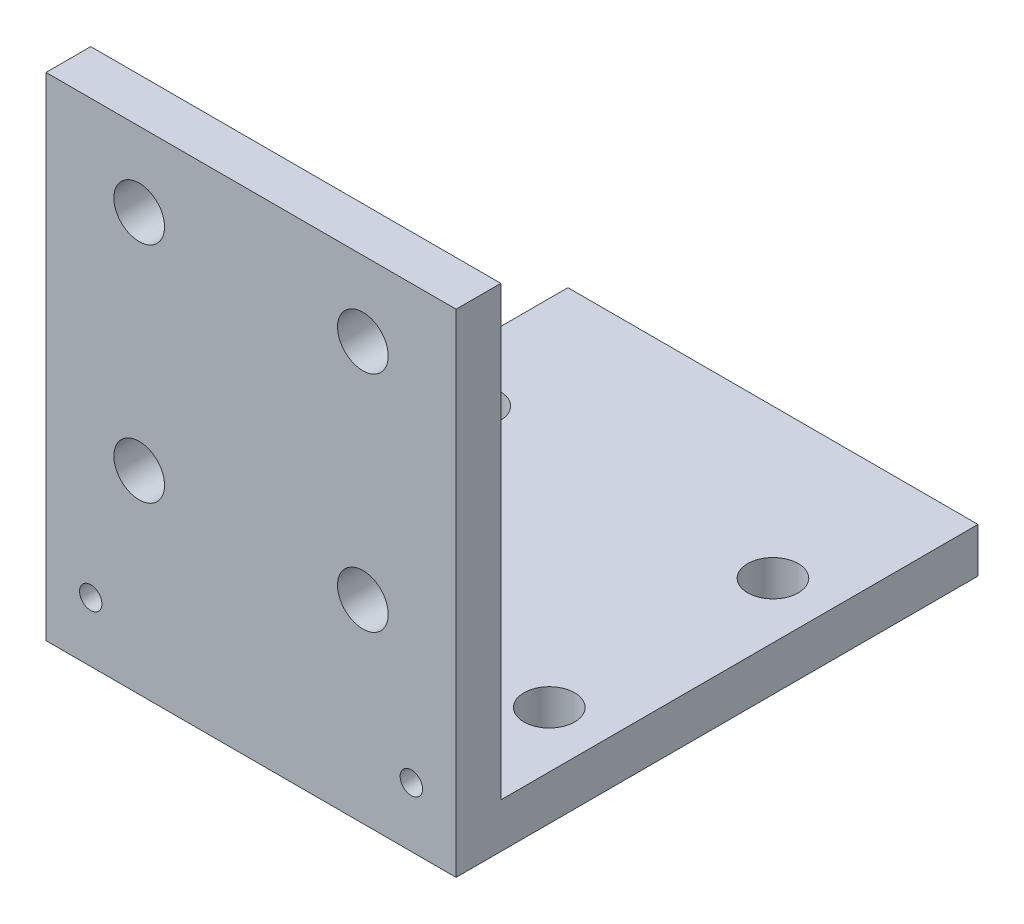
ISO-10303-21;
HEADER;
FILE_DESCRIPTION(('STEP AP214'),'2;1');
FILE_NAME('part.step','',(''),(''),'','','');
FILE_SCHEMA(('AUTOMOTIVE_DESIGN { 1 0 10303 214 1 1 1 1 }'));
ENDSEC;
DATA;
#1=APPLICATION_CONTEXT('core data for automotive mechanical design processes');
#2=APPLICATION_PROTOCOL_DEFINITION('international standard','automotive_design',2000,#1);
#3=PRODUCT_CONTEXT('',#1,'mechanical');
#4=PRODUCT('Part','Part','',(#3));
#5=PRODUCT_RELATED_PRODUCT_CATEGORY('part','',(#4));
#6=PRODUCT_DEFINITION_FORMATION('','',#4);
#7=PRODUCT_DEFINITION_CONTEXT('part definition',#1,'design');
#8=PRODUCT_DEFINITION('design','',#6,#7);
#9=PRODUCT_DEFINITION_SHAPE('','',#8);
#10=(LENGTH_UNIT() NAMED_UNIT(*) SI_UNIT(.MILLI.,.METRE.));
#11=(NAMED_UNIT(*) PLANE_ANGLE_UNIT() SI_UNIT($,.RADIAN.));
#12=(NAMED_UNIT(*) SI_UNIT($,.STERADIAN.) SOLID_ANGLE_UNIT());
#13=UNCERTAINTY_MEASURE_WITH_UNIT(LENGTH_MEASURE(1.E-05),#10,'distance_accuracy_value','');
#14=(GEOMETRIC_REPRESENTATION_CONTEXT(3) GLOBAL_UNCERTAINTY_ASSIGNED_CONTEXT((#13)) GLOBAL_UNIT_ASSIGNED_CONTEXT((#10,
#11,#12)) REPRESENTATION_CONTEXT('',''));
#15=CARTESIAN_POINT('',(0.,0.,0.));
#16=DIRECTION('',(0.,0.,1.));
#17=DIRECTION('',(1.,0.,0.));
#18=AXIS2_PLACEMENT_3D('',#15,#16,#17);
#19=CARTESIAN_POINT('',(13.75,1.5,35.));
#20=DIRECTION('',(-1.,0.,0.));
#21=DIRECTION('',(0.,0.,1.));
#22=AXIS2_PLACEMENT_3D('',#19,#20,#21);
#23=PLANE('',#22);
#24=DIRECTION('',(0.,-1.,0.));
#25=VECTOR('',#24,1.);
#26=CARTESIAN_POINT('',(13.75,41.5,32.));
#27=LINE('',#26,#25);
#28=CARTESIAN_POINT('',(13.75,31.5,32.));
#29=VERTEX_POINT('',#28);
#30=CARTESIAN_POINT('',(13.75,1.5,32.));
#31=VERTEX_POINT('',#30);
#32=EDGE_CURVE('E57',#29,#31,#27,.T.);
#33=ORIENTED_EDGE('',*,*,#32,.F.);
#34=DIRECTION('',(0.,0.,-1.));
#35=VECTOR('',#34,1.);
#36=CARTESIAN_POINT('',(13.75,31.5,35.));
#37=LINE('',#36,#35);
#38=CARTESIAN_POINT('',(13.75,31.5,35.));
#39=VERTEX_POINT('',#38);
#40=EDGE_CURVE('E50',#39,#29,#37,.T.);
#41=ORIENTED_EDGE('',*,*,#40,.F.);
#42=DIRECTION('',(0.,1.,0.));
#43=VECTOR('',#42,1.);
#44=CARTESIAN_POINT('',(13.75,1.5,35.));
#45=LINE('',#44,#43);
#46=CARTESIAN_POINT('',(13.75,-1.5,35.));
#47=VERTEX_POINT('',#46);
#48=EDGE_CURVE('E98',#47,#39,#45,.T.);
#49=ORIENTED_EDGE('',*,*,#48,.F.);
#50=DIRECTION('',(0.,0.,-1.));
#51=VECTOR('',#50,1.);
#52=CARTESIAN_POINT('',(13.75,-1.5,35.));
#53=LINE('',#52,#51);
#54=CARTESIAN_POINT('',(13.75,-1.5,0.));
#55=VERTEX_POINT('',#54);
#56=EDGE_CURVE('E117',#47,#55,#53,.T.);
#57=ORIENTED_EDGE('',*,*,#56,.T.);
#58=DIRECTION('',(0.,1.,0.));
#59=VECTOR('',#58,1.);
#60=CARTESIAN_POINT('',(13.75,1.5,0.));
#61=LINE('',#60,#59);
#62=CARTESIAN_POINT('',(13.75,1.5,0.));
#63=VERTEX_POINT('',#62);
#64=EDGE_CURVE('E118',#55,#63,#61,.T.);
#65=ORIENTED_EDGE('',*,*,#64,.T.);
#66=DIRECTION('',(0.,0.,-1.));
#67=VECTOR('',#66,1.);
#68=CARTESIAN_POINT('',(13.75,1.5,35.));
#69=LINE('',#68,#67);
#70=EDGE_CURVE('E11',#31,#63,#69,.T.);
#71=ORIENTED_EDGE('',*,*,#70,.F.);
#72=EDGE_LOOP('',(#33,#41,#49,#57,#65,#71));
#73=FACE_BOUND('',#72,.T.);
#74=ADVANCED_FACE('F34',(#73),#23,.F.);
#75=CARTESIAN_POINT('',(-13.75,1.5,35.));
#76=DIRECTION('',(0.,-1.,0.));
#77=DIRECTION('',(0.,0.,-1.));
#78=AXIS2_PLACEMENT_3D('',#75,#76,#77);
#79=PLANE('',#78);
#80=CARTESIAN_POINT('',(-10.,1.5,10.));
#81=DIRECTION('',(0.,1.,0.));
#82=DIRECTION('',(0.,0.,1.));
#83=AXIS2_PLACEMENT_3D('',#80,#81,#82);
#84=CIRCLE('',#83,1.69999999999999);
#85=CARTESIAN_POINT('',(-10.,1.5,11.7));
#86=VERTEX_POINT('',#85);
#87=EDGE_CURVE('E131',#86,#86,#84,.T.);
#88=ORIENTED_EDGE('',*,*,#87,.F.);
#89=EDGE_LOOP('',(#88));
#90=FACE_BOUND('',#89,.T.);
#91=CARTESIAN_POINT('',(-9.99999999999999,1.5,25.));
#92=DIRECTION('',(0.,1.,0.));
#93=DIRECTION('',(0.,0.,1.));
#94=AXIS2_PLACEMENT_3D('',#91,#92,#93);
#95=CIRCLE('',#94,1.69999999999999);
#96=CARTESIAN_POINT('',(-9.99999999999999,1.5,26.7));
#97=VERTEX_POINT('',#96);
#98=EDGE_CURVE('E150',#97,#97,#95,.T.);
#99=ORIENTED_EDGE('',*,*,#98,.F.);
#100=EDGE_LOOP('',(#99));
#101=FACE_BOUND('',#100,.T.);
#102=CARTESIAN_POINT('',(10.,1.5,25.));
#103=DIRECTION('',(0.,1.,0.));
#104=DIRECTION('',(0.,0.,1.));
#105=AXIS2_PLACEMENT_3D('',#102,#103,#104);
#106=CIRCLE('',#105,1.69999999999999);
#107=CARTESIAN_POINT('',(10.,1.5,26.7));
#108=VERTEX_POINT('',#107);
#109=EDGE_CURVE('E156',#108,#108,#106,.T.);
#110=ORIENTED_EDGE('',*,*,#109,.F.);
#111=EDGE_LOOP('',(#110));
#112=FACE_BOUND('',#111,.T.);
#113=CARTESIAN_POINT('',(9.99999999999999,1.5,10.));
#114=DIRECTION('',(0.,1.,0.));
#115=DIRECTION('',(0.,0.,1.));
#116=AXIS2_PLACEMENT_3D('',#113,#114,#115);
#117=CIRCLE('',#116,1.69999999999999);
#118=CARTESIAN_POINT('',(9.99999999999999,1.5,11.7));
#119=VERTEX_POINT('',#118);
#120=EDGE_CURVE('E162',#119,#119,#117,.T.);
#121=ORIENTED_EDGE('',*,*,#120,.F.);
#122=EDGE_LOOP('',(#121));
#123=FACE_BOUND('',#122,.T.);
#124=DIRECTION('',(0.,0.,-1.));
#125=VECTOR('',#124,1.);
#126=CARTESIAN_POINT('',(-13.75,1.5,35.));
#127=LINE('',#126,#125);
#128=CARTESIAN_POINT('',(-13.75,1.5,32.));
#129=VERTEX_POINT('',#128);
#130=CARTESIAN_POINT('',(-13.75,1.5,0.));
#131=VERTEX_POINT('',#130);
#132=EDGE_CURVE('E42',#129,#131,#127,.T.);
#133=ORIENTED_EDGE('',*,*,#132,.F.);
#134=DIRECTION('',(1.,0.,0.));
#135=VECTOR('',#134,1.);
#136=CARTESIAN_POINT('',(0.,1.5,32.));
#137=LINE('',#136,#135);
#138=EDGE_CURVE('E168',#129,#31,#137,.T.);
#139=ORIENTED_EDGE('',*,*,#138,.T.);
#140=ORIENTED_EDGE('',*,*,#70,.T.);
#141=DIRECTION('',(-1.,0.,0.));
#142=VECTOR('',#141,1.);
#143=CARTESIAN_POINT('',(-13.75,1.5,0.));
#144=LINE('',#143,#142);
#145=EDGE_CURVE('E121',#63,#131,#144,.T.);
#146=ORIENTED_EDGE('',*,*,#145,.T.);
#147=EDGE_LOOP('',(#133,#139,#140,#146));
#148=FACE_BOUND('',#147,.T.);
#149=ADVANCED_FACE('F176',(#90,#101,#112,#123,#148),#79,.F.);
#150=CARTESIAN_POINT('',(-13.75,1.5,35.));
#151=DIRECTION('',(1.,0.,0.));
#152=DIRECTION('',(0.,0.,-1.));
#153=AXIS2_PLACEMENT_3D('',#150,#151,#152);
#154=PLANE('',#153);
#155=DIRECTION('',(0.,-1.,0.));
#156=VECTOR('',#155,1.);
#157=CARTESIAN_POINT('',(-13.75,1.5,35.));
#158=LINE('',#157,#156);
#159=CARTESIAN_POINT('',(-13.75,31.5,35.));
#160=VERTEX_POINT('',#159);
#161=CARTESIAN_POINT('',(-13.75,-1.5,35.));
#162=VERTEX_POINT('',#161);
#163=EDGE_CURVE('E106',#160,#162,#158,.T.);
#164=ORIENTED_EDGE('',*,*,#163,.F.);
#165=DIRECTION('',(0.,0.,-1.));
#166=VECTOR('',#165,1.);
#167=CARTESIAN_POINT('',(-13.75,31.5,35.));
#168=LINE('',#167,#166);
#169=CARTESIAN_POINT('',(-13.75,31.5,32.));
#170=VERTEX_POINT('',#169);
#171=EDGE_CURVE('E89',#160,#170,#168,.T.);
#172=ORIENTED_EDGE('',*,*,#171,.T.);
#173=DIRECTION('',(0.,-1.,0.));
#174=VECTOR('',#173,1.);
#175=CARTESIAN_POINT('',(-13.75,41.5,32.));
#176=LINE('',#175,#174);
#177=EDGE_CURVE('E113',#170,#129,#176,.T.);
#178=ORIENTED_EDGE('',*,*,#177,.T.);
#179=ORIENTED_EDGE('',*,*,#132,.T.);
#180=DIRECTION('',(0.,-1.,0.));
#181=VECTOR('',#180,1.);
#182=CARTESIAN_POINT('',(-13.75,1.5,0.));
#183=LINE('',#182,#181);
#184=CARTESIAN_POINT('',(-13.75,-1.5,0.));
#185=VERTEX_POINT('',#184);
#186=EDGE_CURVE('E110',#131,#185,#183,.T.);
#187=ORIENTED_EDGE('',*,*,#186,.T.);
#188=DIRECTION('',(0.,0.,-1.));
#189=VECTOR('',#188,1.);
#190=CARTESIAN_POINT('',(-13.75,-1.5,35.));
#191=LINE('',#190,#189);
#192=EDGE_CURVE('E126',#162,#185,#191,.T.);
#193=ORIENTED_EDGE('',*,*,#192,.F.);
#194=EDGE_LOOP('',(#164,#172,#178,#179,#187,#193));
#195=FACE_BOUND('',#194,.T.);
#196=ADVANCED_FACE('F171',(#195),#154,.F.);
#197=CARTESIAN_POINT('',(-13.75,-1.5,35.));
#198=DIRECTION('',(0.,1.,0.));
#199=DIRECTION('',(0.,0.,1.));
#200=AXIS2_PLACEMENT_3D('',#197,#198,#199);
#201=PLANE('',#200);
#202=CARTESIAN_POINT('',(-10.,-1.5,10.));
#203=DIRECTION('',(0.,1.,0.));
#204=DIRECTION('',(0.,0.,1.));
#205=AXIS2_PLACEMENT_3D('',#202,#203,#204);
#206=CIRCLE('',#205,1.69999999999999);
#207=CARTESIAN_POINT('',(-10.,-1.5,11.7));
#208=VERTEX_POINT('',#207);
#209=EDGE_CURVE('E136',#208,#208,#206,.T.);
#210=ORIENTED_EDGE('',*,*,#209,.T.);
#211=EDGE_LOOP('',(#210));
#212=FACE_BOUND('',#211,.T.);
#213=CARTESIAN_POINT('',(-9.99999999999999,-1.5,25.));
#214=DIRECTION('',(0.,1.,0.));
#215=DIRECTION('',(0.,0.,1.));
#216=AXIS2_PLACEMENT_3D('',#213,#214,#215);
#217=CIRCLE('',#216,1.69999999999999);
#218=CARTESIAN_POINT('',(-9.99999999999999,-1.5,26.7));
#219=VERTEX_POINT('',#218);
#220=EDGE_CURVE('E153',#219,#219,#217,.T.);
#221=ORIENTED_EDGE('',*,*,#220,.T.);
#222=EDGE_LOOP('',(#221));
#223=FACE_BOUND('',#222,.T.);
#224=CARTESIAN_POINT('',(10.,-1.5,25.));
#225=DIRECTION('',(0.,1.,0.));
#226=DIRECTION('',(0.,0.,1.));
#227=AXIS2_PLACEMENT_3D('',#224,#225,#226);
#228=CIRCLE('',#227,1.69999999999999);
#229=CARTESIAN_POINT('',(10.,-1.5,26.7));
#230=VERTEX_POINT('',#229);
#231=EDGE_CURVE('E159',#230,#230,#228,.T.);
#232=ORIENTED_EDGE('',*,*,#231,.T.);
#233=EDGE_LOOP('',(#232));
#234=FACE_BOUND('',#233,.T.);
#235=CARTESIAN_POINT('',(9.99999999999999,-1.5,10.));
#236=DIRECTION('',(0.,1.,0.));
#237=DIRECTION('',(0.,0.,1.));
#238=AXIS2_PLACEMENT_3D('',#235,#236,#237);
#239=CIRCLE('',#238,1.69999999999999);
#240=CARTESIAN_POINT('',(9.99999999999999,-1.5,11.7));
#241=VERTEX_POINT('',#240);
#242=EDGE_CURVE('E165',#241,#241,#239,.T.);
#243=ORIENTED_EDGE('',*,*,#242,.T.);
#244=EDGE_LOOP('',(#243));
#245=FACE_BOUND('',#244,.T.);
#246=DIRECTION('',(1.,0.,0.));
#247=VECTOR('',#246,1.);
#248=CARTESIAN_POINT('',(-13.75,-1.5,0.));
#249=LINE('',#248,#247);
#250=EDGE_CURVE('E107',#185,#55,#249,.T.);
#251=ORIENTED_EDGE('',*,*,#250,.T.);
#252=ORIENTED_EDGE('',*,*,#56,.F.);
#253=DIRECTION('',(1.,0.,0.));
#254=VECTOR('',#253,1.);
#255=CARTESIAN_POINT('',(-13.75,-1.5,35.));
#256=LINE('',#255,#254);
#257=EDGE_CURVE('E104',#162,#47,#256,.T.);
#258=ORIENTED_EDGE('',*,*,#257,.F.);
#259=ORIENTED_EDGE('',*,*,#192,.T.);
#260=EDGE_LOOP('',(#251,#252,#258,#259));
#261=FACE_BOUND('',#260,.T.);
#262=ADVANCED_FACE('F185',(#212,#223,#234,#245,#261),#201,.F.);
#263=CARTESIAN_POINT('',(0.,0.,35.));
#264=DIRECTION('',(0.,0.,1.));
#265=DIRECTION('',(1.,0.,0.));
#266=AXIS2_PLACEMENT_3D('',#263,#264,#265);
#267=PLANE('',#266);
#268=DIRECTION('',(-1.,0.,0.));
#269=VECTOR('',#268,1.);
#270=CARTESIAN_POINT('',(0.,31.5,35.));
#271=LINE('',#270,#269);
#272=EDGE_CURVE('E86',#39,#160,#271,.T.);
#273=ORIENTED_EDGE('',*,*,#272,.T.);
#274=ORIENTED_EDGE('',*,*,#163,.T.);
#275=ORIENTED_EDGE('',*,*,#257,.T.);
#276=ORIENTED_EDGE('',*,*,#48,.T.);
#277=EDGE_LOOP('',(#273,#274,#275,#276));
#278=FACE_BOUND('',#277,.T.);
#279=CARTESIAN_POINT('',(10.75,2.5,35.));
#280=DIRECTION('',(0.,0.,-1.));
#281=DIRECTION('',(-1.,0.,0.));
#282=AXIS2_PLACEMENT_3D('',#279,#280,#281);
#283=CIRCLE('',#282,0.75);
#284=CARTESIAN_POINT('',(10.,2.5,35.));
#285=VERTEX_POINT('',#284);
#286=EDGE_CURVE('E409',#285,#285,#283,.T.);
#287=ORIENTED_EDGE('',*,*,#286,.T.);
#288=EDGE_LOOP('',(#287));
#289=FACE_BOUND('',#288,.T.);
#290=CARTESIAN_POINT('',(7.5,11.5,35.));
#291=DIRECTION('',(0.,0.,1.));
#292=DIRECTION('',(1.,0.,0.));
#293=AXIS2_PLACEMENT_3D('',#290,#291,#292);
#294=CIRCLE('',#293,1.69999999999999);
#295=CARTESIAN_POINT('',(9.19999999999999,11.5,35.));
#296=VERTEX_POINT('',#295);
#297=EDGE_CURVE('E403',#296,#296,#294,.T.);
#298=ORIENTED_EDGE('',*,*,#297,.F.);
#299=EDGE_LOOP('',(#298));
#300=FACE_BOUND('',#299,.T.);
#301=CARTESIAN_POINT('',(-7.5,11.5,35.));
#302=DIRECTION('',(0.,0.,1.));
#303=DIRECTION('',(1.,0.,0.));
#304=AXIS2_PLACEMENT_3D('',#301,#302,#303);
#305=CIRCLE('',#304,1.69999999999999);
#306=CARTESIAN_POINT('',(-5.80000000000001,11.5,35.));
#307=VERTEX_POINT('',#306);
#308=EDGE_CURVE('E397',#307,#307,#305,.T.);
#309=ORIENTED_EDGE('',*,*,#308,.F.);
#310=EDGE_LOOP('',(#309));
#311=FACE_BOUND('',#310,.T.);
#312=CARTESIAN_POINT('',(-7.5,26.5,35.));
#313=DIRECTION('',(0.,0.,1.));
#314=DIRECTION('',(1.,0.,0.));
#315=AXIS2_PLACEMENT_3D('',#312,#313,#314);
#316=CIRCLE('',#315,1.69999999999999);
#317=CARTESIAN_POINT('',(-5.80000000000001,26.5,35.));
#318=VERTEX_POINT('',#317);
#319=EDGE_CURVE('E390',#318,#318,#316,.T.);
#320=ORIENTED_EDGE('',*,*,#319,.F.);
#321=EDGE_LOOP('',(#320));
#322=FACE_BOUND('',#321,.T.);
#323=CARTESIAN_POINT('',(7.5,26.5,35.));
#324=DIRECTION('',(0.,0.,1.));
#325=DIRECTION('',(1.,0.,0.));
#326=AXIS2_PLACEMENT_3D('',#323,#324,#325);
#327=CIRCLE('',#326,1.69999999999999);
#328=CARTESIAN_POINT('',(9.19999999999999,26.5,35.));
#329=VERTEX_POINT('',#328);
#330=EDGE_CURVE('E139',#329,#329,#327,.T.);
#331=ORIENTED_EDGE('',*,*,#330,.F.);
#332=EDGE_LOOP('',(#331));
#333=FACE_BOUND('',#332,.T.);
#334=CARTESIAN_POINT('',(-10.75,2.5,35.));
#335=DIRECTION('',(0.,0.,1.));
#336=DIRECTION('',(1.,0.,0.));
#337=AXIS2_PLACEMENT_3D('',#334,#335,#336);
#338=CIRCLE('',#337,0.75);
#339=CARTESIAN_POINT('',(-10.,2.5,35.));
#340=VERTEX_POINT('',#339);
#341=EDGE_CURVE('E132',#340,#340,#338,.T.);
#342=ORIENTED_EDGE('',*,*,#341,.F.);
#343=EDGE_LOOP('',(#342));
#344=FACE_BOUND('',#343,.T.);
#345=ADVANCED_FACE('F101',(#278,#289,#300,#311,#322,#333,#344),#267,.T.);
#346=CARTESIAN_POINT('',(0.,0.,0.));
#347=DIRECTION('',(0.,0.,1.));
#348=DIRECTION('',(1.,0.,0.));
#349=AXIS2_PLACEMENT_3D('',#346,#347,#348);
#350=PLANE('',#349);
#351=ORIENTED_EDGE('',*,*,#64,.F.);
#352=ORIENTED_EDGE('',*,*,#250,.F.);
#353=ORIENTED_EDGE('',*,*,#186,.F.);
#354=ORIENTED_EDGE('',*,*,#145,.F.);
#355=EDGE_LOOP('',(#351,#352,#353,#354));
#356=FACE_BOUND('',#355,.T.);
#357=ADVANCED_FACE('F182',(#356),#350,.F.);
#358=CARTESIAN_POINT('',(0.,41.5,32.));
#359=DIRECTION('',(0.,0.,-1.));
#360=DIRECTION('',(-1.,0.,0.));
#361=AXIS2_PLACEMENT_3D('',#358,#359,#360);
#362=PLANE('',#361);
#363=DIRECTION('',(-1.,0.,0.));
#364=VECTOR('',#363,1.);
#365=CARTESIAN_POINT('',(0.,31.5,32.));
#366=LINE('',#365,#364);
#367=EDGE_CURVE('E93',#29,#170,#366,.T.);
#368=ORIENTED_EDGE('',*,*,#367,.F.);
#369=ORIENTED_EDGE('',*,*,#32,.T.);
#370=ORIENTED_EDGE('',*,*,#138,.F.);
#371=ORIENTED_EDGE('',*,*,#177,.F.);
#372=EDGE_LOOP('',(#368,#369,#370,#371));
#373=FACE_BOUND('',#372,.T.);
#374=CARTESIAN_POINT('',(10.75,2.5,32.));
#375=DIRECTION('',(0.,0.,-1.));
#376=DIRECTION('',(-1.,0.,0.));
#377=AXIS2_PLACEMENT_3D('',#374,#375,#376);
#378=CIRCLE('',#377,0.75);
#379=CARTESIAN_POINT('',(10.,2.5,32.));
#380=VERTEX_POINT('',#379);
#381=EDGE_CURVE('E37',#380,#380,#378,.F.);
#382=ORIENTED_EDGE('',*,*,#381,.T.);
#383=EDGE_LOOP('',(#382));
#384=FACE_BOUND('',#383,.T.);
#385=CARTESIAN_POINT('',(7.5,11.5,32.));
#386=DIRECTION('',(0.,0.,-1.));
#387=DIRECTION('',(-1.,0.,0.));
#388=AXIS2_PLACEMENT_3D('',#385,#386,#387);
#389=CIRCLE('',#388,1.69999999999999);
#390=CARTESIAN_POINT('',(5.80000000000001,11.5,32.));
#391=VERTEX_POINT('',#390);
#392=EDGE_CURVE('E406',#391,#391,#389,.T.);
#393=ORIENTED_EDGE('',*,*,#392,.F.);
#394=EDGE_LOOP('',(#393));
#395=FACE_BOUND('',#394,.T.);
#396=CARTESIAN_POINT('',(-7.5,11.5,32.));
#397=DIRECTION('',(0.,0.,-1.));
#398=DIRECTION('',(-1.,0.,0.));
#399=AXIS2_PLACEMENT_3D('',#396,#397,#398);
#400=CIRCLE('',#399,1.69999999999999);
#401=CARTESIAN_POINT('',(-9.19999999999999,11.5,32.));
#402=VERTEX_POINT('',#401);
#403=EDGE_CURVE('E400',#402,#402,#400,.T.);
#404=ORIENTED_EDGE('',*,*,#403,.F.);
#405=EDGE_LOOP('',(#404));
#406=FACE_BOUND('',#405,.T.);
#407=CARTESIAN_POINT('',(-7.5,26.5,32.));
#408=DIRECTION('',(0.,0.,-1.));
#409=DIRECTION('',(-1.,0.,0.));
#410=AXIS2_PLACEMENT_3D('',#407,#408,#409);
#411=CIRCLE('',#410,1.69999999999999);
#412=CARTESIAN_POINT('',(-9.19999999999999,26.5,32.));
#413=VERTEX_POINT('',#412);
#414=EDGE_CURVE('E392',#413,#413,#411,.T.);
#415=ORIENTED_EDGE('',*,*,#414,.F.);
#416=EDGE_LOOP('',(#415));
#417=FACE_BOUND('',#416,.T.);
#418=CARTESIAN_POINT('',(7.5,26.5,32.));
#419=DIRECTION('',(0.,0.,-1.));
#420=DIRECTION('',(-1.,0.,0.));
#421=AXIS2_PLACEMENT_3D('',#418,#419,#420);
#422=CIRCLE('',#421,1.69999999999999);
#423=CARTESIAN_POINT('',(5.80000000000001,26.5,32.));
#424=VERTEX_POINT('',#423);
#425=EDGE_CURVE('E144',#424,#424,#422,.T.);
#426=ORIENTED_EDGE('',*,*,#425,.F.);
#427=EDGE_LOOP('',(#426));
#428=FACE_BOUND('',#427,.T.);
#429=CARTESIAN_POINT('',(-10.75,2.5,32.));
#430=DIRECTION('',(0.,0.,-1.));
#431=DIRECTION('',(-1.,0.,0.));
#432=AXIS2_PLACEMENT_3D('',#429,#430,#431);
#433=CIRCLE('',#432,0.75);
#434=CARTESIAN_POINT('',(-11.5,2.5,32.));
#435=VERTEX_POINT('',#434);
#436=EDGE_CURVE('E129',#435,#435,#433,.T.);
#437=ORIENTED_EDGE('',*,*,#436,.F.);
#438=EDGE_LOOP('',(#437));
#439=FACE_BOUND('',#438,.T.);
#440=ADVANCED_FACE('F173',(#373,#384,#395,#406,#417,#428,#439),#362,.T.);
#441=CARTESIAN_POINT('',(9.99999999999999,1.5,10.));
#442=DIRECTION('',(0.,1.,0.));
#443=DIRECTION('',(0.,0.,1.));
#444=AXIS2_PLACEMENT_3D('',#441,#442,#443);
#445=CYLINDRICAL_SURFACE('',#444,1.69999999999999);
#446=ORIENTED_EDGE('',*,*,#120,.T.);
#447=EDGE_LOOP('',(#446));
#448=FACE_BOUND('',#447,.T.);
#449=ORIENTED_EDGE('',*,*,#242,.F.);
#450=EDGE_LOOP('',(#449));
#451=FACE_BOUND('',#450,.T.);
#452=ADVANCED_FACE('F212',(#448,#451),#445,.F.);
#453=CARTESIAN_POINT('',(10.,1.5,25.));
#454=DIRECTION('',(0.,1.,0.));
#455=DIRECTION('',(0.,0.,1.));
#456=AXIS2_PLACEMENT_3D('',#453,#454,#455);
#457=CYLINDRICAL_SURFACE('',#456,1.69999999999999);
#458=ORIENTED_EDGE('',*,*,#109,.T.);
#459=EDGE_LOOP('',(#458));
#460=FACE_BOUND('',#459,.T.);
#461=ORIENTED_EDGE('',*,*,#231,.F.);
#462=EDGE_LOOP('',(#461));
#463=FACE_BOUND('',#462,.T.);
#464=ADVANCED_FACE('F215',(#460,#463),#457,.F.);
#465=CARTESIAN_POINT('',(-9.99999999999999,1.5,25.));
#466=DIRECTION('',(0.,1.,0.));
#467=DIRECTION('',(0.,0.,1.));
#468=AXIS2_PLACEMENT_3D('',#465,#466,#467);
#469=CYLINDRICAL_SURFACE('',#468,1.69999999999999);
#470=ORIENTED_EDGE('',*,*,#98,.T.);
#471=EDGE_LOOP('',(#470));
#472=FACE_BOUND('',#471,.T.);
#473=ORIENTED_EDGE('',*,*,#220,.F.);
#474=EDGE_LOOP('',(#473));
#475=FACE_BOUND('',#474,.T.);
#476=ADVANCED_FACE('F223',(#472,#475),#469,.F.);
#477=CARTESIAN_POINT('',(-10.,1.5,10.));
#478=DIRECTION('',(0.,1.,0.));
#479=DIRECTION('',(0.,0.,1.));
#480=AXIS2_PLACEMENT_3D('',#477,#478,#479);
#481=CYLINDRICAL_SURFACE('',#480,1.69999999999999);
#482=ORIENTED_EDGE('',*,*,#87,.T.);
#483=EDGE_LOOP('',(#482));
#484=FACE_BOUND('',#483,.T.);
#485=ORIENTED_EDGE('',*,*,#209,.F.);
#486=EDGE_LOOP('',(#485));
#487=FACE_BOUND('',#486,.T.);
#488=ADVANCED_FACE('F298',(#484,#487),#481,.F.);
#489=CARTESIAN_POINT('',(-10.75,2.5,25.));
#490=DIRECTION('',(0.,0.,1.));
#491=DIRECTION('',(1.,0.,0.));
#492=AXIS2_PLACEMENT_3D('',#489,#490,#491);
#493=CYLINDRICAL_SURFACE('',#492,0.75);
#494=ORIENTED_EDGE('',*,*,#436,.T.);
#495=EDGE_LOOP('',(#494));
#496=FACE_BOUND('',#495,.T.);
#497=ORIENTED_EDGE('',*,*,#341,.T.);
#498=EDGE_LOOP('',(#497));
#499=FACE_BOUND('',#498,.T.);
#500=ADVANCED_FACE('F290',(#496,#499),#493,.F.);
#501=CARTESIAN_POINT('',(7.5,26.5,32.));
#502=DIRECTION('',(0.,0.,-1.));
#503=DIRECTION('',(-1.,0.,0.));
#504=AXIS2_PLACEMENT_3D('',#501,#502,#503);
#505=CYLINDRICAL_SURFACE('',#504,1.69999999999999);
#506=ORIENTED_EDGE('',*,*,#330,.T.);
#507=EDGE_LOOP('',(#506));
#508=FACE_BOUND('',#507,.T.);
#509=ORIENTED_EDGE('',*,*,#425,.T.);
#510=EDGE_LOOP('',(#509));
#511=FACE_BOUND('',#510,.T.);
#512=ADVANCED_FACE('F282',(#508,#511),#505,.F.);
#513=CARTESIAN_POINT('',(-7.5,26.5,32.));
#514=DIRECTION('',(0.,0.,-1.));
#515=DIRECTION('',(-1.,0.,0.));
#516=AXIS2_PLACEMENT_3D('',#513,#514,#515);
#517=CYLINDRICAL_SURFACE('',#516,1.69999999999999);
#518=ORIENTED_EDGE('',*,*,#319,.T.);
#519=EDGE_LOOP('',(#518));
#520=FACE_BOUND('',#519,.T.);
#521=ORIENTED_EDGE('',*,*,#414,.T.);
#522=EDGE_LOOP('',(#521));
#523=FACE_BOUND('',#522,.T.);
#524=ADVANCED_FACE('F274',(#520,#523),#517,.F.);
#525=CARTESIAN_POINT('',(-7.5,11.5,32.));
#526=DIRECTION('',(0.,0.,-1.));
#527=DIRECTION('',(-1.,0.,0.));
#528=AXIS2_PLACEMENT_3D('',#525,#526,#527);
#529=CYLINDRICAL_SURFACE('',#528,1.69999999999999);
#530=ORIENTED_EDGE('',*,*,#308,.T.);
#531=EDGE_LOOP('',(#530));
#532=FACE_BOUND('',#531,.T.);
#533=ORIENTED_EDGE('',*,*,#403,.T.);
#534=EDGE_LOOP('',(#533));
#535=FACE_BOUND('',#534,.T.);
#536=ADVANCED_FACE('F266',(#532,#535),#529,.F.);
#537=CARTESIAN_POINT('',(7.5,11.5,32.));
#538=DIRECTION('',(0.,0.,-1.));
#539=DIRECTION('',(-1.,0.,0.));
#540=AXIS2_PLACEMENT_3D('',#537,#538,#539);
#541=CYLINDRICAL_SURFACE('',#540,1.69999999999999);
#542=ORIENTED_EDGE('',*,*,#297,.T.);
#543=EDGE_LOOP('',(#542));
#544=FACE_BOUND('',#543,.T.);
#545=ORIENTED_EDGE('',*,*,#392,.T.);
#546=EDGE_LOOP('',(#545));
#547=FACE_BOUND('',#546,.T.);
#548=ADVANCED_FACE('F259',(#544,#547),#541,.F.);
#549=CARTESIAN_POINT('',(10.75,2.5,25.));
#550=DIRECTION('',(0.,0.,1.));
#551=DIRECTION('',(1.,0.,0.));
#552=AXIS2_PLACEMENT_3D('',#549,#550,#551);
#553=CYLINDRICAL_SURFACE('',#552,0.75);
#554=ORIENTED_EDGE('',*,*,#381,.F.);
#555=EDGE_LOOP('',(#554));
#556=FACE_BOUND('',#555,.T.);
#557=ORIENTED_EDGE('',*,*,#286,.F.);
#558=EDGE_LOOP('',(#557));
#559=FACE_BOUND('',#558,.T.);
#560=ADVANCED_FACE('F249',(#556,#559),#553,.F.);
#561=CARTESIAN_POINT('',(0.,31.5,35.));
#562=DIRECTION('',(0.,-1.,0.));
#563=DIRECTION('',(0.,0.,-1.));
#564=AXIS2_PLACEMENT_3D('',#561,#562,#563);
#565=PLANE('',#564);
#566=ORIENTED_EDGE('',*,*,#367,.T.);
#567=ORIENTED_EDGE('',*,*,#171,.F.);
#568=ORIENTED_EDGE('',*,*,#272,.F.);
#569=ORIENTED_EDGE('',*,*,#40,.T.);
#570=EDGE_LOOP('',(#566,#567,#568,#569));
#571=FACE_BOUND('',#570,.T.);
#572=ADVANCED_FACE('F87',(#571),#565,.F.);
#573=CLOSED_SHELL('',(#74,#149,#196,#262,#345,#357,#440,#452,#464,#476,#488,#500,#512,#524,#536,
#548,#560,#572));
#574=MANIFOLD_SOLID_BREP('B2',#573);
#575=ADVANCED_BREP_SHAPE_REPRESENTATION('',(#18,#574),#14);
#576=SHAPE_DEFINITION_REPRESENTATION(#9,#575);
ENDSEC;
END-ISO-10303-21;
